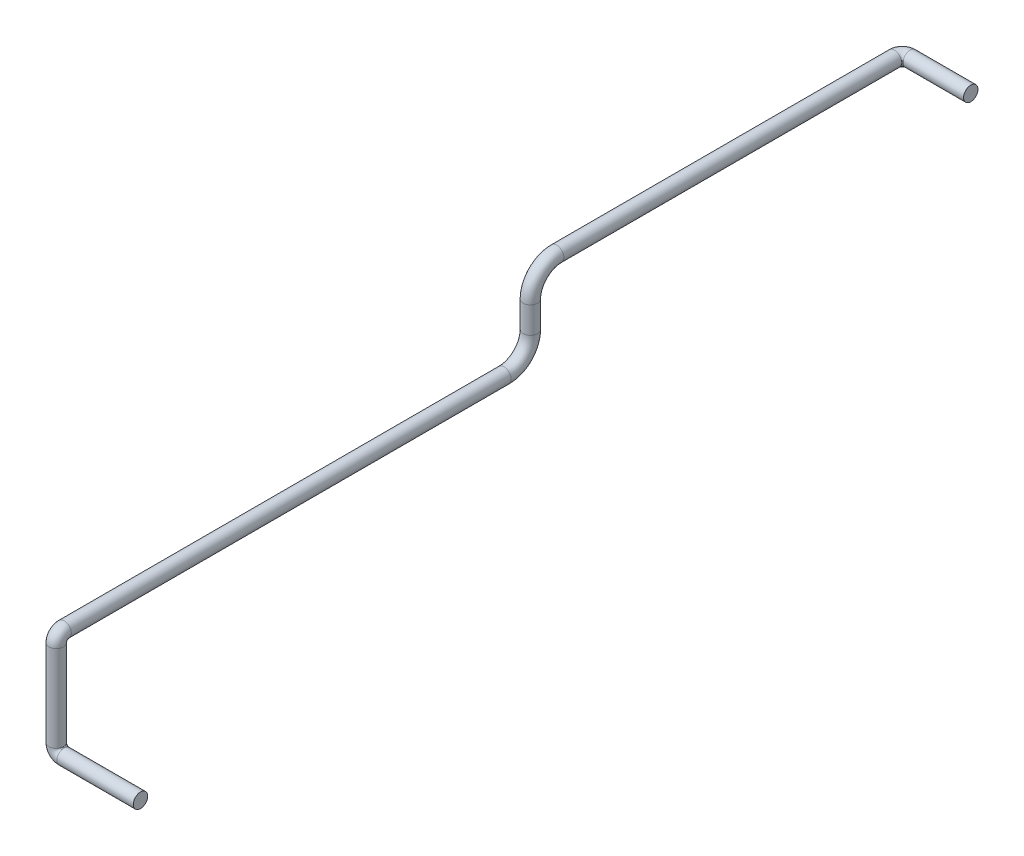
ISO-10303-21;
HEADER;
FILE_DESCRIPTION(('STEP AP214'),'2;1');
FILE_NAME('part.step','',(''),(''),'','','');
FILE_SCHEMA(('AUTOMOTIVE_DESIGN { 1 0 10303 214 1 1 1 1 }'));
ENDSEC;
DATA;
#1=APPLICATION_CONTEXT('core data for automotive mechanical design processes');
#2=APPLICATION_PROTOCOL_DEFINITION('international standard','automotive_design',2000,#1);
#3=PRODUCT_CONTEXT('',#1,'mechanical');
#4=PRODUCT('Part','Part','',(#3));
#5=PRODUCT_RELATED_PRODUCT_CATEGORY('part','',(#4));
#6=PRODUCT_DEFINITION_FORMATION('','',#4);
#7=PRODUCT_DEFINITION_CONTEXT('part definition',#1,'design');
#8=PRODUCT_DEFINITION('design','',#6,#7);
#9=PRODUCT_DEFINITION_SHAPE('','',#8);
#10=(LENGTH_UNIT() NAMED_UNIT(*) SI_UNIT(.MILLI.,.METRE.));
#11=(NAMED_UNIT(*) PLANE_ANGLE_UNIT() SI_UNIT($,.RADIAN.));
#12=(NAMED_UNIT(*) SI_UNIT($,.STERADIAN.) SOLID_ANGLE_UNIT());
#13=UNCERTAINTY_MEASURE_WITH_UNIT(LENGTH_MEASURE(1.E-05),#10,'distance_accuracy_value','');
#14=(GEOMETRIC_REPRESENTATION_CONTEXT(3) GLOBAL_UNCERTAINTY_ASSIGNED_CONTEXT((#13)) GLOBAL_UNIT_ASSIGNED_CONTEXT((#10,
#11,#12)) REPRESENTATION_CONTEXT('',''));
#15=CARTESIAN_POINT('',(0.,0.,0.));
#16=DIRECTION('',(0.,0.,1.));
#17=DIRECTION('',(1.,0.,0.));
#18=AXIS2_PLACEMENT_3D('',#15,#16,#17);
#19=CARTESIAN_POINT('',(0.,0.,0.));
#20=DIRECTION('',(1.,0.,0.));
#21=DIRECTION('',(0.,0.,-1.));
#22=AXIS2_PLACEMENT_3D('',#19,#20,#21);
#23=PLANE('',#22);
#24=CARTESIAN_POINT('',(0.,0.,0.));
#25=DIRECTION('',(1.,0.,0.));
#26=DIRECTION('',(0.,0.,-1.));
#27=AXIS2_PLACEMENT_3D('',#24,#25,#26);
#28=CIRCLE('',#27,13.7);
#29=CARTESIAN_POINT('',(0.,0.,-13.7));
#30=VERTEX_POINT('',#29);
#31=EDGE_CURVE('E49',#30,#30,#28,.T.);
#32=ORIENTED_EDGE('',*,*,#31,.T.);
#33=EDGE_LOOP('',(#32));
#34=FACE_BOUND('',#33,.T.);
#35=ADVANCED_FACE('F37',(#34),#23,.T.);
#36=CARTESIAN_POINT('',(-30.0000000000001,344.,-1606.));
#37=DIRECTION('',(-1.,0.,0.));
#38=DIRECTION('',(0.,-1.,0.));
#39=AXIS2_PLACEMENT_3D('',#36,#37,#38);
#40=PLANE('',#39);
#41=CARTESIAN_POINT('',(-30.0000000000001,344.,-1606.));
#42=DIRECTION('',(-1.,0.,0.));
#43=DIRECTION('',(0.,-1.,0.));
#44=AXIS2_PLACEMENT_3D('',#41,#42,#43);
#45=CIRCLE('',#44,13.7);
#46=CARTESIAN_POINT('',(-30.0000000000001,330.3,-1606.));
#47=VERTEX_POINT('',#46);
#48=EDGE_CURVE('E11',#47,#47,#45,.T.);
#49=ORIENTED_EDGE('',*,*,#48,.F.);
#50=EDGE_LOOP('',(#49));
#51=FACE_BOUND('',#50,.T.);
#52=ADVANCED_FACE('F55',(#51),#40,.F.);
#53=CARTESIAN_POINT('',(0.,0.,0.));
#54=DIRECTION('',(-1.,0.,0.));
#55=DIRECTION('',(0.,0.,1.));
#56=AXIS2_PLACEMENT_3D('',#53,#54,#55);
#57=CYLINDRICAL_SURFACE('',#56,13.7);
#58=CARTESIAN_POINT('',(-145.,0.,0.));
#59=DIRECTION('',(1.,0.,0.));
#60=DIRECTION('',(0.,0.,-1.));
#61=AXIS2_PLACEMENT_3D('',#58,#59,#60);
#62=CIRCLE('',#61,13.7);
#63=CARTESIAN_POINT('',(-145.,-13.7,0.));
#64=VERTEX_POINT('',#63);
#65=EDGE_CURVE('E113',#64,#64,#62,.T.);
#66=ORIENTED_EDGE('',*,*,#65,.T.);
#67=EDGE_LOOP('',(#66));
#68=FACE_BOUND('',#67,.T.);
#69=ORIENTED_EDGE('',*,*,#31,.F.);
#70=EDGE_LOOP('',(#69));
#71=FACE_BOUND('',#70,.T.);
#72=ADVANCED_FACE('F57',(#68,#71),#57,.T.);
#73=CARTESIAN_POINT('',(-145.,15.,0.));
#74=DIRECTION('',(0.,0.,-1.));
#75=DIRECTION('',(-1.,0.,0.));
#76=AXIS2_PLACEMENT_3D('',#73,#74,#75);
#77=TOROIDAL_SURFACE('',#76,15.,13.7);
#78=CARTESIAN_POINT('',(-160.,15.,0.));
#79=DIRECTION('',(0.,-1.,0.));
#80=DIRECTION('',(0.,0.,-1.));
#81=AXIS2_PLACEMENT_3D('',#78,#79,#80);
#82=CIRCLE('',#81,13.7);
#83=CARTESIAN_POINT('',(-173.7,15.,0.));
#84=VERTEX_POINT('',#83);
#85=EDGE_CURVE('E110',#84,#84,#82,.T.);
#86=CARTESIAN_POINT('',(-145.,15.,0.));
#87=DIRECTION('',(0.,0.,-1.));
#88=DIRECTION('',(-1.,0.,0.));
#89=AXIS2_PLACEMENT_3D('',#86,#87,#88);
#90=CIRCLE('',#89,28.7);
#91=EDGE_CURVE('',#64,#84,#90,.T.);
#92=ORIENTED_EDGE('',*,*,#65,.F.);
#93=ORIENTED_EDGE('',*,*,#85,.T.);
#94=ORIENTED_EDGE('',*,*,#91,.T.);
#95=ORIENTED_EDGE('',*,*,#91,.F.);
#96=EDGE_LOOP('',(#92,#94,#93,#95));
#97=FACE_BOUND('',#96,.T.);
#98=ADVANCED_FACE('F62',(#97),#77,.T.);
#99=CARTESIAN_POINT('',(-160.,15.,0.));
#100=DIRECTION('',(0.,1.,0.));
#101=DIRECTION('',(0.,0.,1.));
#102=AXIS2_PLACEMENT_3D('',#99,#100,#101);
#103=CYLINDRICAL_SURFACE('',#102,13.7);
#104=CARTESIAN_POINT('',(-160.,179.,0.));
#105=DIRECTION('',(0.,-1.,0.));
#106=DIRECTION('',(0.,0.,-1.));
#107=AXIS2_PLACEMENT_3D('',#104,#105,#106);
#108=CIRCLE('',#107,13.7);
#109=CARTESIAN_POINT('',(-160.,179.,13.7));
#110=VERTEX_POINT('',#109);
#111=EDGE_CURVE('E115',#110,#110,#108,.T.);
#112=ORIENTED_EDGE('',*,*,#111,.T.);
#113=EDGE_LOOP('',(#112));
#114=FACE_BOUND('',#113,.T.);
#115=ORIENTED_EDGE('',*,*,#85,.F.);
#116=EDGE_LOOP('',(#115));
#117=FACE_BOUND('',#116,.T.);
#118=ADVANCED_FACE('F98',(#114,#117),#103,.T.);
#119=CARTESIAN_POINT('',(-160.,179.,-15.));
#120=DIRECTION('',(-1.,0.,0.));
#121=DIRECTION('',(0.,0.,1.));
#122=AXIS2_PLACEMENT_3D('',#119,#120,#121);
#123=TOROIDAL_SURFACE('',#122,15.,13.7);
#124=CARTESIAN_POINT('',(-160.,194.,-15.));
#125=DIRECTION('',(0.,0.,1.));
#126=DIRECTION('',(0.,-1.,0.));
#127=AXIS2_PLACEMENT_3D('',#124,#125,#126);
#128=CIRCLE('',#127,13.7);
#129=CARTESIAN_POINT('',(-160.,207.7,-15.));
#130=VERTEX_POINT('',#129);
#131=EDGE_CURVE('E121',#130,#130,#128,.T.);
#132=CARTESIAN_POINT('',(-160.,179.,-15.));
#133=DIRECTION('',(-1.,0.,0.));
#134=DIRECTION('',(0.,0.,1.));
#135=AXIS2_PLACEMENT_3D('',#132,#133,#134);
#136=CIRCLE('',#135,28.7);
#137=EDGE_CURVE('',#110,#130,#136,.T.);
#138=ORIENTED_EDGE('',*,*,#111,.F.);
#139=ORIENTED_EDGE('',*,*,#131,.T.);
#140=ORIENTED_EDGE('',*,*,#137,.T.);
#141=ORIENTED_EDGE('',*,*,#137,.F.);
#142=EDGE_LOOP('',(#138,#140,#139,#141));
#143=FACE_BOUND('',#142,.T.);
#144=ADVANCED_FACE('F94',(#143),#123,.T.);
#145=CARTESIAN_POINT('',(-160.,194.,-15.));
#146=DIRECTION('',(0.,0.,-1.));
#147=DIRECTION('',(0.,1.,0.));
#148=AXIS2_PLACEMENT_3D('',#145,#146,#147);
#149=CYLINDRICAL_SURFACE('',#148,13.7);
#150=CARTESIAN_POINT('',(-160.,194.,-850.));
#151=DIRECTION('',(0.,0.,1.));
#152=DIRECTION('',(0.,-1.,0.));
#153=AXIS2_PLACEMENT_3D('',#150,#151,#152);
#154=CIRCLE('',#153,13.7);
#155=CARTESIAN_POINT('',(-160.,180.3,-850.));
#156=VERTEX_POINT('',#155);
#157=EDGE_CURVE('E124',#156,#156,#154,.T.);
#158=ORIENTED_EDGE('',*,*,#157,.T.);
#159=EDGE_LOOP('',(#158));
#160=FACE_BOUND('',#159,.T.);
#161=ORIENTED_EDGE('',*,*,#131,.F.);
#162=EDGE_LOOP('',(#161));
#163=FACE_BOUND('',#162,.T.);
#164=ADVANCED_FACE('F90',(#160,#163),#149,.T.);
#165=CARTESIAN_POINT('',(-160.,244.,-850.));
#166=DIRECTION('',(1.,0.,0.));
#167=DIRECTION('',(0.,0.,-1.));
#168=AXIS2_PLACEMENT_3D('',#165,#166,#167);
#169=TOROIDAL_SURFACE('',#168,50.,13.7);
#170=CARTESIAN_POINT('',(-160.,244.,-900.));
#171=DIRECTION('',(0.,-1.,0.));
#172=DIRECTION('',(0.,0.,-1.));
#173=AXIS2_PLACEMENT_3D('',#170,#171,#172);
#174=CIRCLE('',#173,13.7);
#175=CARTESIAN_POINT('',(-160.,244.,-913.7));
#176=VERTEX_POINT('',#175);
#177=EDGE_CURVE('E127',#176,#176,#174,.T.);
#178=CARTESIAN_POINT('',(-160.,244.,-850.));
#179=DIRECTION('',(1.,0.,0.));
#180=DIRECTION('',(0.,0.,-1.));
#181=AXIS2_PLACEMENT_3D('',#178,#179,#180);
#182=CIRCLE('',#181,63.7);
#183=EDGE_CURVE('',#156,#176,#182,.T.);
#184=ORIENTED_EDGE('',*,*,#157,.F.);
#185=ORIENTED_EDGE('',*,*,#177,.T.);
#186=ORIENTED_EDGE('',*,*,#183,.T.);
#187=ORIENTED_EDGE('',*,*,#183,.F.);
#188=EDGE_LOOP('',(#184,#186,#185,#187));
#189=FACE_BOUND('',#188,.T.);
#190=ADVANCED_FACE('F86',(#189),#169,.T.);
#191=CARTESIAN_POINT('',(-160.,244.,-900.));
#192=DIRECTION('',(0.,1.,0.));
#193=DIRECTION('',(-1.,0.,0.));
#194=AXIS2_PLACEMENT_3D('',#191,#192,#193);
#195=CYLINDRICAL_SURFACE('',#194,13.7);
#196=CARTESIAN_POINT('',(-160.,294.,-900.));
#197=DIRECTION('',(0.,-1.,0.));
#198=DIRECTION('',(0.,0.,-1.));
#199=AXIS2_PLACEMENT_3D('',#196,#197,#198);
#200=CIRCLE('',#199,13.7);
#201=CARTESIAN_POINT('',(-160.,294.,-886.3));
#202=VERTEX_POINT('',#201);
#203=EDGE_CURVE('E130',#202,#202,#200,.T.);
#204=ORIENTED_EDGE('',*,*,#203,.T.);
#205=EDGE_LOOP('',(#204));
#206=FACE_BOUND('',#205,.T.);
#207=ORIENTED_EDGE('',*,*,#177,.F.);
#208=EDGE_LOOP('',(#207));
#209=FACE_BOUND('',#208,.T.);
#210=ADVANCED_FACE('F82',(#206,#209),#195,.T.);
#211=CARTESIAN_POINT('',(-160.,294.,-950.));
#212=DIRECTION('',(-1.,0.,0.));
#213=DIRECTION('',(0.,0.,1.));
#214=AXIS2_PLACEMENT_3D('',#211,#212,#213);
#215=TOROIDAL_SURFACE('',#214,50.,13.7);
#216=CARTESIAN_POINT('',(-160.,344.,-950.));
#217=DIRECTION('',(0.,0.,1.));
#218=DIRECTION('',(0.,-1.,0.));
#219=AXIS2_PLACEMENT_3D('',#216,#217,#218);
#220=CIRCLE('',#219,13.7);
#221=CARTESIAN_POINT('',(-160.,357.7,-950.));
#222=VERTEX_POINT('',#221);
#223=EDGE_CURVE('E133',#222,#222,#220,.T.);
#224=CARTESIAN_POINT('',(-160.,294.,-950.));
#225=DIRECTION('',(-1.,0.,0.));
#226=DIRECTION('',(0.,0.,1.));
#227=AXIS2_PLACEMENT_3D('',#224,#225,#226);
#228=CIRCLE('',#227,63.7);
#229=EDGE_CURVE('',#202,#222,#228,.T.);
#230=ORIENTED_EDGE('',*,*,#203,.F.);
#231=ORIENTED_EDGE('',*,*,#223,.T.);
#232=ORIENTED_EDGE('',*,*,#229,.T.);
#233=ORIENTED_EDGE('',*,*,#229,.F.);
#234=EDGE_LOOP('',(#230,#232,#231,#233));
#235=FACE_BOUND('',#234,.T.);
#236=ADVANCED_FACE('F78',(#235),#215,.T.);
#237=CARTESIAN_POINT('',(-160.,344.,-950.));
#238=DIRECTION('',(0.,0.,-1.));
#239=DIRECTION('',(-1.,0.,0.));
#240=AXIS2_PLACEMENT_3D('',#237,#238,#239);
#241=CYLINDRICAL_SURFACE('',#240,13.7);
#242=CARTESIAN_POINT('',(-160.,344.,-1591.));
#243=DIRECTION('',(0.,0.,1.));
#244=DIRECTION('',(0.,-1.,0.));
#245=AXIS2_PLACEMENT_3D('',#242,#243,#244);
#246=CIRCLE('',#245,13.7);
#247=CARTESIAN_POINT('',(-173.7,344.,-1591.));
#248=VERTEX_POINT('',#247);
#249=EDGE_CURVE('E136',#248,#248,#246,.T.);
#250=ORIENTED_EDGE('',*,*,#249,.T.);
#251=EDGE_LOOP('',(#250));
#252=FACE_BOUND('',#251,.T.);
#253=ORIENTED_EDGE('',*,*,#223,.F.);
#254=EDGE_LOOP('',(#253));
#255=FACE_BOUND('',#254,.T.);
#256=ADVANCED_FACE('F72',(#252,#255),#241,.T.);
#257=CARTESIAN_POINT('',(-145.,344.,-1591.));
#258=DIRECTION('',(0.,-1.,0.));
#259=DIRECTION('',(0.,0.,-1.));
#260=AXIS2_PLACEMENT_3D('',#257,#258,#259);
#261=TOROIDAL_SURFACE('',#260,14.9999999999999,13.7);
#262=CARTESIAN_POINT('',(-145.,344.,-1606.));
#263=DIRECTION('',(-1.,0.,0.));
#264=DIRECTION('',(0.,-1.,0.));
#265=AXIS2_PLACEMENT_3D('',#262,#263,#264);
#266=CIRCLE('',#265,13.7);
#267=CARTESIAN_POINT('',(-145.,344.,-1619.7));
#268=VERTEX_POINT('',#267);
#269=EDGE_CURVE('E44',#268,#268,#266,.T.);
#270=CARTESIAN_POINT('',(-145.,344.,-1591.));
#271=DIRECTION('',(0.,-1.,0.));
#272=DIRECTION('',(0.,0.,-1.));
#273=AXIS2_PLACEMENT_3D('',#270,#271,#272);
#274=CIRCLE('',#273,28.6999999999999);
#275=EDGE_CURVE('',#248,#268,#274,.T.);
#276=ORIENTED_EDGE('',*,*,#249,.F.);
#277=ORIENTED_EDGE('',*,*,#269,.T.);
#278=ORIENTED_EDGE('',*,*,#275,.T.);
#279=ORIENTED_EDGE('',*,*,#275,.F.);
#280=EDGE_LOOP('',(#276,#278,#277,#279));
#281=FACE_BOUND('',#280,.T.);
#282=ADVANCED_FACE('F68',(#281),#261,.T.);
#283=CARTESIAN_POINT('',(-145.,344.,-1606.));
#284=DIRECTION('',(1.,0.,0.));
#285=DIRECTION('',(0.,0.,-1.));
#286=AXIS2_PLACEMENT_3D('',#283,#284,#285);
#287=CYLINDRICAL_SURFACE('',#286,13.7);
#288=ORIENTED_EDGE('',*,*,#48,.T.);
#289=EDGE_LOOP('',(#288));
#290=FACE_BOUND('',#289,.T.);
#291=ORIENTED_EDGE('',*,*,#269,.F.);
#292=EDGE_LOOP('',(#291));
#293=FACE_BOUND('',#292,.T.);
#294=ADVANCED_FACE('F52',(#290,#293),#287,.T.);
#295=CLOSED_SHELL('',(#35,#52,#72,#98,#118,#144,#164,#190,#210,#236,#256,#282,#294));
#296=MANIFOLD_SOLID_BREP('B2',#295);
#297=ADVANCED_BREP_SHAPE_REPRESENTATION('',(#18,#296),#14);
#298=SHAPE_DEFINITION_REPRESENTATION(#9,#297);
ENDSEC;
END-ISO-10303-21;
